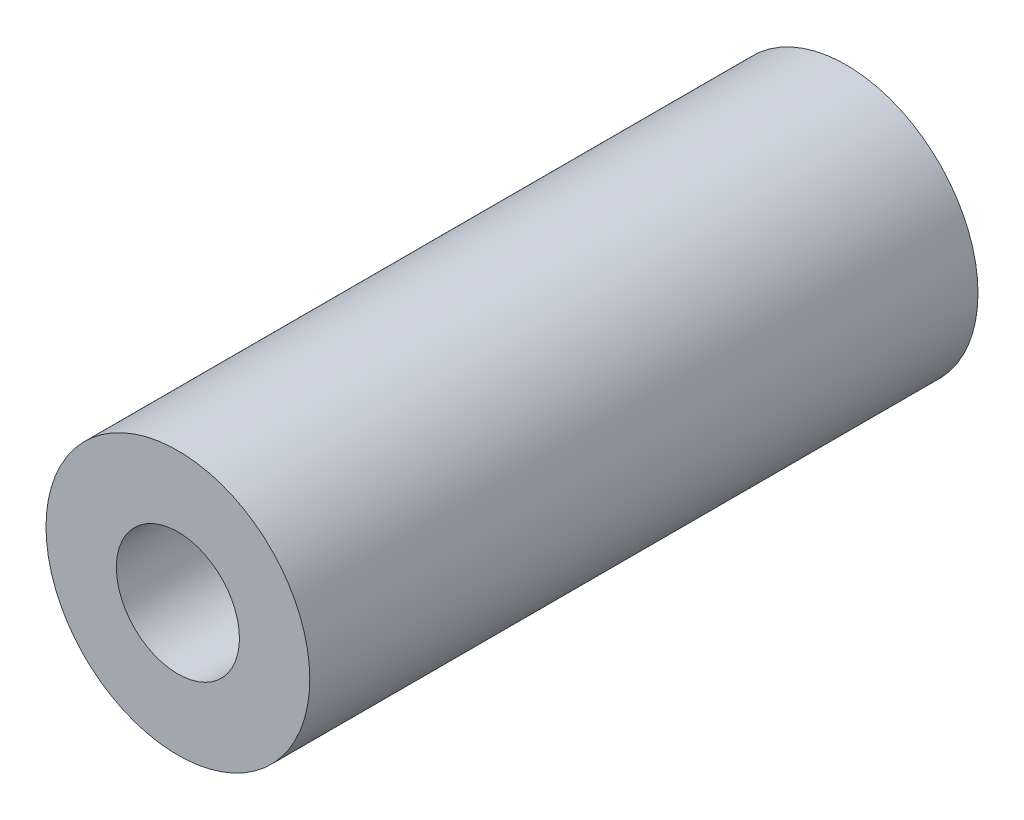
ISO-10303-21;
HEADER;
FILE_DESCRIPTION(('STEP AP214'),'2;1');
FILE_NAME('part.step','',(''),(''),'','','');
FILE_SCHEMA(('AUTOMOTIVE_DESIGN { 1 0 10303 214 1 1 1 1 }'));
ENDSEC;
DATA;
#1=APPLICATION_CONTEXT('core data for automotive mechanical design processes');
#2=APPLICATION_PROTOCOL_DEFINITION('international standard','automotive_design',2000,#1);
#3=PRODUCT_CONTEXT('',#1,'mechanical');
#4=PRODUCT('Part','Part','',(#3));
#5=PRODUCT_RELATED_PRODUCT_CATEGORY('part','',(#4));
#6=PRODUCT_DEFINITION_FORMATION('','',#4);
#7=PRODUCT_DEFINITION_CONTEXT('part definition',#1,'design');
#8=PRODUCT_DEFINITION('design','',#6,#7);
#9=PRODUCT_DEFINITION_SHAPE('','',#8);
#10=(LENGTH_UNIT() NAMED_UNIT(*) SI_UNIT(.MILLI.,.METRE.));
#11=(NAMED_UNIT(*) PLANE_ANGLE_UNIT() SI_UNIT($,.RADIAN.));
#12=(NAMED_UNIT(*) SI_UNIT($,.STERADIAN.) SOLID_ANGLE_UNIT());
#13=UNCERTAINTY_MEASURE_WITH_UNIT(LENGTH_MEASURE(1.E-05),#10,'distance_accuracy_value','');
#14=(GEOMETRIC_REPRESENTATION_CONTEXT(3) GLOBAL_UNCERTAINTY_ASSIGNED_CONTEXT((#13)) GLOBAL_UNIT_ASSIGNED_CONTEXT((#10,
#11,#12)) REPRESENTATION_CONTEXT('',''));
#15=CARTESIAN_POINT('',(0.,0.,0.));
#16=DIRECTION('',(0.,0.,1.));
#17=DIRECTION('',(1.,0.,0.));
#18=AXIS2_PLACEMENT_3D('',#15,#16,#17);
#19=CARTESIAN_POINT('',(0.,0.,19.));
#20=DIRECTION('',(0.,0.,1.));
#21=DIRECTION('',(1.,0.,0.));
#22=AXIS2_PLACEMENT_3D('',#19,#20,#21);
#23=PLANE('',#22);
#24=CARTESIAN_POINT('',(0.,0.,19.));
#25=DIRECTION('',(0.,0.,1.));
#26=DIRECTION('',(1.,0.,0.));
#27=AXIS2_PLACEMENT_3D('',#24,#25,#26);
#28=CIRCLE('',#27,3.75);
#29=CARTESIAN_POINT('',(3.75,0.,19.));
#30=VERTEX_POINT('',#29);
#31=EDGE_CURVE('E10',#30,#30,#28,.T.);
#32=ORIENTED_EDGE('',*,*,#31,.T.);
#33=EDGE_LOOP('',(#32));
#34=FACE_BOUND('',#33,.T.);
#35=CARTESIAN_POINT('',(0.,0.,19.));
#36=DIRECTION('',(0.,0.,1.));
#37=DIRECTION('',(1.,0.,0.));
#38=AXIS2_PLACEMENT_3D('',#35,#36,#37);
#39=CIRCLE('',#38,1.75);
#40=CARTESIAN_POINT('',(1.75,0.,19.));
#41=VERTEX_POINT('',#40);
#42=EDGE_CURVE('E54',#41,#41,#39,.T.);
#43=ORIENTED_EDGE('',*,*,#42,.F.);
#44=EDGE_LOOP('',(#43));
#45=FACE_BOUND('',#44,.T.);
#46=ADVANCED_FACE('F41',(#34,#45),#23,.T.);
#47=CARTESIAN_POINT('',(0.,0.,0.));
#48=DIRECTION('',(0.,0.,1.));
#49=DIRECTION('',(1.,0.,0.));
#50=AXIS2_PLACEMENT_3D('',#47,#48,#49);
#51=PLANE('',#50);
#52=CARTESIAN_POINT('',(0.,0.,0.));
#53=DIRECTION('',(0.,0.,1.));
#54=DIRECTION('',(1.,0.,0.));
#55=AXIS2_PLACEMENT_3D('',#52,#53,#54);
#56=CIRCLE('',#55,3.75);
#57=CARTESIAN_POINT('',(3.75,0.,0.));
#58=VERTEX_POINT('',#57);
#59=EDGE_CURVE('E45',#58,#58,#56,.T.);
#60=ORIENTED_EDGE('',*,*,#59,.F.);
#61=EDGE_LOOP('',(#60));
#62=FACE_BOUND('',#61,.T.);
#63=CARTESIAN_POINT('',(0.,0.,0.));
#64=DIRECTION('',(0.,0.,1.));
#65=DIRECTION('',(1.,0.,0.));
#66=AXIS2_PLACEMENT_3D('',#63,#64,#65);
#67=CIRCLE('',#66,1.75);
#68=CARTESIAN_POINT('',(1.75,0.,0.));
#69=VERTEX_POINT('',#68);
#70=EDGE_CURVE('E56',#69,#69,#67,.T.);
#71=ORIENTED_EDGE('',*,*,#70,.T.);
#72=EDGE_LOOP('',(#71));
#73=FACE_BOUND('',#72,.T.);
#74=ADVANCED_FACE('F68',(#62,#73),#51,.F.);
#75=CARTESIAN_POINT('',(0.,0.,19.));
#76=DIRECTION('',(0.,0.,-1.));
#77=DIRECTION('',(-1.,0.,0.));
#78=AXIS2_PLACEMENT_3D('',#75,#76,#77);
#79=CYLINDRICAL_SURFACE('',#78,3.75);
#80=ORIENTED_EDGE('',*,*,#31,.F.);
#81=EDGE_LOOP('',(#80));
#82=FACE_BOUND('',#81,.T.);
#83=ORIENTED_EDGE('',*,*,#59,.T.);
#84=EDGE_LOOP('',(#83));
#85=FACE_BOUND('',#84,.T.);
#86=ADVANCED_FACE('F43',(#82,#85),#79,.T.);
#87=CARTESIAN_POINT('',(0.,0.,19.));
#88=DIRECTION('',(0.,0.,-1.));
#89=DIRECTION('',(-1.,0.,0.));
#90=AXIS2_PLACEMENT_3D('',#87,#88,#89);
#91=CYLINDRICAL_SURFACE('',#90,1.75);
#92=ORIENTED_EDGE('',*,*,#42,.T.);
#93=EDGE_LOOP('',(#92));
#94=FACE_BOUND('',#93,.T.);
#95=ORIENTED_EDGE('',*,*,#70,.F.);
#96=EDGE_LOOP('',(#95));
#97=FACE_BOUND('',#96,.T.);
#98=ADVANCED_FACE('F64',(#94,#97),#91,.F.);
#99=CLOSED_SHELL('',(#46,#74,#86,#98));
#100=MANIFOLD_SOLID_BREP('B2',#99);
#101=ADVANCED_BREP_SHAPE_REPRESENTATION('',(#18,#100),#14);
#102=SHAPE_DEFINITION_REPRESENTATION(#9,#101);
ENDSEC;
END-ISO-10303-21;
